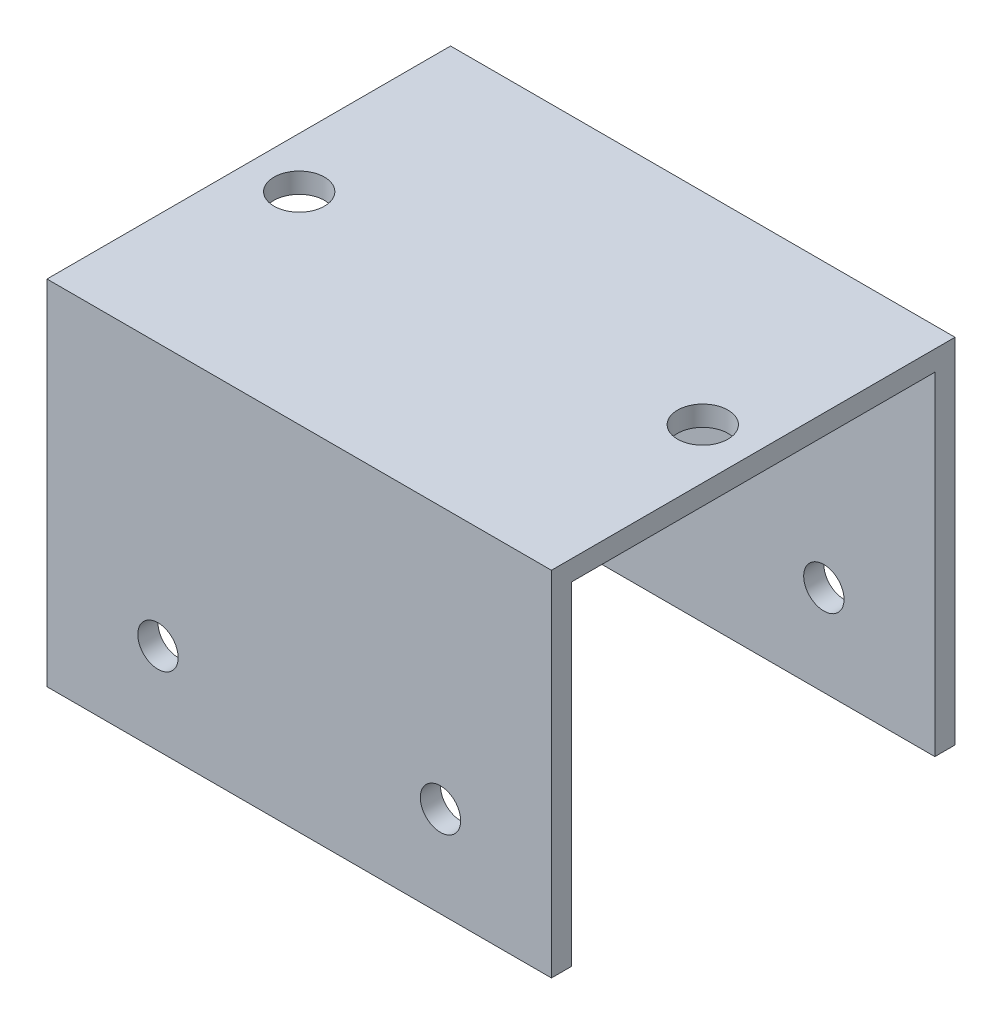
ISO-10303-21;
HEADER;
FILE_DESCRIPTION(('STEP AP214'),'2;1');
FILE_NAME('part.step','',(''),(''),'','','');
FILE_SCHEMA(('AUTOMOTIVE_DESIGN { 1 0 10303 214 1 1 1 1 }'));
ENDSEC;
DATA;
#1=APPLICATION_CONTEXT('core data for automotive mechanical design processes');
#2=APPLICATION_PROTOCOL_DEFINITION('international standard','automotive_design',2000,#1);
#3=PRODUCT_CONTEXT('',#1,'mechanical');
#4=PRODUCT('Part','Part','',(#3));
#5=PRODUCT_RELATED_PRODUCT_CATEGORY('part','',(#4));
#6=PRODUCT_DEFINITION_FORMATION('','',#4);
#7=PRODUCT_DEFINITION_CONTEXT('part definition',#1,'design');
#8=PRODUCT_DEFINITION('design','',#6,#7);
#9=PRODUCT_DEFINITION_SHAPE('','',#8);
#10=(LENGTH_UNIT() NAMED_UNIT(*) SI_UNIT(.MILLI.,.METRE.));
#11=(NAMED_UNIT(*) PLANE_ANGLE_UNIT() SI_UNIT($,.RADIAN.));
#12=(NAMED_UNIT(*) SI_UNIT($,.STERADIAN.) SOLID_ANGLE_UNIT());
#13=UNCERTAINTY_MEASURE_WITH_UNIT(LENGTH_MEASURE(1.E-05),#10,'distance_accuracy_value','');
#14=(GEOMETRIC_REPRESENTATION_CONTEXT(3) GLOBAL_UNCERTAINTY_ASSIGNED_CONTEXT((#13)) GLOBAL_UNIT_ASSIGNED_CONTEXT((#10,
#11,#12)) REPRESENTATION_CONTEXT('',''));
#15=CARTESIAN_POINT('',(0.,0.,0.));
#16=DIRECTION('',(0.,0.,1.));
#17=DIRECTION('',(1.,0.,0.));
#18=AXIS2_PLACEMENT_3D('',#15,#16,#17);
#19=CARTESIAN_POINT('',(25.,0.,-18.));
#20=DIRECTION('',(0.,1.,0.));
#21=DIRECTION('',(0.,0.,1.));
#22=AXIS2_PLACEMENT_3D('',#19,#20,#21);
#23=PLANE('',#22);
#24=DIRECTION('',(0.,0.,-1.));
#25=VECTOR('',#24,1.);
#26=CARTESIAN_POINT('',(-25.,0.,-18.));
#27=LINE('',#26,#25);
#28=CARTESIAN_POINT('',(-25.,0.,-18.));
#29=VERTEX_POINT('',#28);
#30=CARTESIAN_POINT('',(-25.,0.,-20.));
#31=VERTEX_POINT('',#30);
#32=EDGE_CURVE('E134',#29,#31,#27,.T.);
#33=ORIENTED_EDGE('',*,*,#32,.T.);
#34=DIRECTION('',(-1.,0.,0.));
#35=VECTOR('',#34,1.);
#36=CARTESIAN_POINT('',(25.,0.,-20.));
#37=LINE('',#36,#35);
#38=CARTESIAN_POINT('',(25.,0.,-20.));
#39=VERTEX_POINT('',#38);
#40=EDGE_CURVE('E11',#39,#31,#37,.T.);
#41=ORIENTED_EDGE('',*,*,#40,.F.);
#42=DIRECTION('',(0.,0.,-1.));
#43=VECTOR('',#42,1.);
#44=CARTESIAN_POINT('',(25.,0.,-18.));
#45=LINE('',#44,#43);
#46=CARTESIAN_POINT('',(25.,0.,-18.));
#47=VERTEX_POINT('',#46);
#48=EDGE_CURVE('E149',#47,#39,#45,.T.);
#49=ORIENTED_EDGE('',*,*,#48,.F.);
#50=DIRECTION('',(-1.,0.,0.));
#51=VECTOR('',#50,1.);
#52=CARTESIAN_POINT('',(25.,0.,-18.));
#53=LINE('',#52,#51);
#54=EDGE_CURVE('E130',#47,#29,#53,.T.);
#55=ORIENTED_EDGE('',*,*,#54,.T.);
#56=EDGE_LOOP('',(#33,#41,#49,#55));
#57=FACE_BOUND('',#56,.T.);
#58=ADVANCED_FACE('F36',(#57),#23,.F.);
#59=CARTESIAN_POINT('',(25.,35.,-20.));
#60=DIRECTION('',(0.,0.,1.));
#61=DIRECTION('',(0.,-1.,0.));
#62=AXIS2_PLACEMENT_3D('',#59,#60,#61);
#63=PLANE('',#62);
#64=CARTESIAN_POINT('',(14.,9.,-20.));
#65=DIRECTION('',(0.,0.,1.));
#66=DIRECTION('',(1.,0.,0.));
#67=AXIS2_PLACEMENT_3D('',#64,#65,#66);
#68=CIRCLE('',#67,2.);
#69=CARTESIAN_POINT('',(16.,9.,-20.));
#70=VERTEX_POINT('',#69);
#71=EDGE_CURVE('E168',#70,#70,#68,.T.);
#72=ORIENTED_EDGE('',*,*,#71,.T.);
#73=EDGE_LOOP('',(#72));
#74=FACE_BOUND('',#73,.T.);
#75=CARTESIAN_POINT('',(-14.,9.,-20.));
#76=DIRECTION('',(0.,0.,1.));
#77=DIRECTION('',(1.,0.,0.));
#78=AXIS2_PLACEMENT_3D('',#75,#76,#77);
#79=CIRCLE('',#78,2.);
#80=CARTESIAN_POINT('',(-12.,9.,-20.));
#81=VERTEX_POINT('',#80);
#82=EDGE_CURVE('E164',#81,#81,#79,.T.);
#83=ORIENTED_EDGE('',*,*,#82,.T.);
#84=EDGE_LOOP('',(#83));
#85=FACE_BOUND('',#84,.T.);
#86=DIRECTION('',(0.,1.,0.));
#87=VECTOR('',#86,1.);
#88=CARTESIAN_POINT('',(-25.,35.,-20.));
#89=LINE('',#88,#87);
#90=CARTESIAN_POINT('',(-25.,35.,-20.));
#91=VERTEX_POINT('',#90);
#92=EDGE_CURVE('E137',#31,#91,#89,.T.);
#93=ORIENTED_EDGE('',*,*,#92,.T.);
#94=DIRECTION('',(-1.,0.,0.));
#95=VECTOR('',#94,1.);
#96=CARTESIAN_POINT('',(25.,35.,-20.));
#97=LINE('',#96,#95);
#98=CARTESIAN_POINT('',(25.,35.,-20.));
#99=VERTEX_POINT('',#98);
#100=EDGE_CURVE('E45',#99,#91,#97,.T.);
#101=ORIENTED_EDGE('',*,*,#100,.F.);
#102=DIRECTION('',(0.,1.,0.));
#103=VECTOR('',#102,1.);
#104=CARTESIAN_POINT('',(25.,35.,-20.));
#105=LINE('',#104,#103);
#106=EDGE_CURVE('E97',#39,#99,#105,.T.);
#107=ORIENTED_EDGE('',*,*,#106,.F.);
#108=ORIENTED_EDGE('',*,*,#40,.T.);
#109=EDGE_LOOP('',(#93,#101,#107,#108));
#110=FACE_BOUND('',#109,.T.);
#111=ADVANCED_FACE('F233',(#74,#85,#110),#63,.F.);
#112=CARTESIAN_POINT('',(25.,35.,20.));
#113=DIRECTION('',(0.,-1.,0.));
#114=DIRECTION('',(0.,0.,-1.));
#115=AXIS2_PLACEMENT_3D('',#112,#113,#114);
#116=PLANE('',#115);
#117=CARTESIAN_POINT('',(19.9999999999767,35.,0.));
#118=DIRECTION('',(0.,1.,0.));
#119=DIRECTION('',(0.,0.,1.));
#120=AXIS2_PLACEMENT_3D('',#117,#118,#119);
#121=CIRCLE('',#120,2.5);
#122=CARTESIAN_POINT('',(19.9999999999767,35.,2.5));
#123=VERTEX_POINT('',#122);
#124=EDGE_CURVE('E182',#123,#123,#121,.T.);
#125=ORIENTED_EDGE('',*,*,#124,.F.);
#126=EDGE_LOOP('',(#125));
#127=FACE_BOUND('',#126,.T.);
#128=CARTESIAN_POINT('',(-20.,35.,0.));
#129=DIRECTION('',(0.,1.,0.));
#130=DIRECTION('',(0.,0.,1.));
#131=AXIS2_PLACEMENT_3D('',#128,#129,#130);
#132=CIRCLE('',#131,2.5);
#133=CARTESIAN_POINT('',(-20.,35.,2.5));
#134=VERTEX_POINT('',#133);
#135=EDGE_CURVE('E172',#134,#134,#132,.T.);
#136=ORIENTED_EDGE('',*,*,#135,.F.);
#137=EDGE_LOOP('',(#136));
#138=FACE_BOUND('',#137,.T.);
#139=DIRECTION('',(0.,0.,1.));
#140=VECTOR('',#139,1.);
#141=CARTESIAN_POINT('',(-25.,35.,20.));
#142=LINE('',#141,#140);
#143=CARTESIAN_POINT('',(-25.,35.,20.));
#144=VERTEX_POINT('',#143);
#145=EDGE_CURVE('E140',#91,#144,#142,.T.);
#146=ORIENTED_EDGE('',*,*,#145,.T.);
#147=DIRECTION('',(-1.,0.,0.));
#148=VECTOR('',#147,1.);
#149=CARTESIAN_POINT('',(25.,35.,20.));
#150=LINE('',#149,#148);
#151=CARTESIAN_POINT('',(25.,35.,20.));
#152=VERTEX_POINT('',#151);
#153=EDGE_CURVE('E156',#152,#144,#150,.T.);
#154=ORIENTED_EDGE('',*,*,#153,.F.);
#155=DIRECTION('',(0.,0.,1.));
#156=VECTOR('',#155,1.);
#157=CARTESIAN_POINT('',(25.,35.,20.));
#158=LINE('',#157,#156);
#159=EDGE_CURVE('E198',#99,#152,#158,.T.);
#160=ORIENTED_EDGE('',*,*,#159,.F.);
#161=ORIENTED_EDGE('',*,*,#100,.T.);
#162=EDGE_LOOP('',(#146,#154,#160,#161));
#163=FACE_BOUND('',#162,.T.);
#164=ADVANCED_FACE('F237',(#127,#138,#163),#116,.F.);
#165=CARTESIAN_POINT('',(25.,35.,20.));
#166=DIRECTION('',(0.,0.,-1.));
#167=DIRECTION('',(0.,1.,0.));
#168=AXIS2_PLACEMENT_3D('',#165,#166,#167);
#169=PLANE('',#168);
#170=CARTESIAN_POINT('',(14.,9.,20.));
#171=DIRECTION('',(0.,0.,1.));
#172=DIRECTION('',(1.,0.,0.));
#173=AXIS2_PLACEMENT_3D('',#170,#171,#172);
#174=CIRCLE('',#173,2.);
#175=CARTESIAN_POINT('',(16.,9.,20.));
#176=VERTEX_POINT('',#175);
#177=EDGE_CURVE('E171',#176,#176,#174,.T.);
#178=ORIENTED_EDGE('',*,*,#177,.F.);
#179=EDGE_LOOP('',(#178));
#180=FACE_BOUND('',#179,.T.);
#181=CARTESIAN_POINT('',(-14.,9.,20.));
#182=DIRECTION('',(0.,0.,1.));
#183=DIRECTION('',(1.,0.,0.));
#184=AXIS2_PLACEMENT_3D('',#181,#182,#183);
#185=CIRCLE('',#184,2.);
#186=CARTESIAN_POINT('',(-12.,9.,20.));
#187=VERTEX_POINT('',#186);
#188=EDGE_CURVE('E189',#187,#187,#185,.T.);
#189=ORIENTED_EDGE('',*,*,#188,.F.);
#190=EDGE_LOOP('',(#189));
#191=FACE_BOUND('',#190,.T.);
#192=DIRECTION('',(0.,-1.,0.));
#193=VECTOR('',#192,1.);
#194=CARTESIAN_POINT('',(-25.,35.,20.));
#195=LINE('',#194,#193);
#196=CARTESIAN_POINT('',(-25.,0.,20.));
#197=VERTEX_POINT('',#196);
#198=EDGE_CURVE('E142',#144,#197,#195,.T.);
#199=ORIENTED_EDGE('',*,*,#198,.T.);
#200=DIRECTION('',(-1.,0.,0.));
#201=VECTOR('',#200,1.);
#202=CARTESIAN_POINT('',(25.,0.,20.));
#203=LINE('',#202,#201);
#204=CARTESIAN_POINT('',(25.,0.,20.));
#205=VERTEX_POINT('',#204);
#206=EDGE_CURVE('E153',#205,#197,#203,.T.);
#207=ORIENTED_EDGE('',*,*,#206,.F.);
#208=DIRECTION('',(0.,-1.,0.));
#209=VECTOR('',#208,1.);
#210=CARTESIAN_POINT('',(25.,35.,20.));
#211=LINE('',#210,#209);
#212=EDGE_CURVE('E200',#152,#205,#211,.T.);
#213=ORIENTED_EDGE('',*,*,#212,.F.);
#214=ORIENTED_EDGE('',*,*,#153,.T.);
#215=EDGE_LOOP('',(#199,#207,#213,#214));
#216=FACE_BOUND('',#215,.T.);
#217=ADVANCED_FACE('F206',(#180,#191,#216),#169,.F.);
#218=CARTESIAN_POINT('',(25.,0.,20.));
#219=DIRECTION('',(0.,1.,0.));
#220=DIRECTION('',(0.,0.,1.));
#221=AXIS2_PLACEMENT_3D('',#218,#219,#220);
#222=PLANE('',#221);
#223=DIRECTION('',(0.,0.,-1.));
#224=VECTOR('',#223,1.);
#225=CARTESIAN_POINT('',(-25.,0.,20.));
#226=LINE('',#225,#224);
#227=CARTESIAN_POINT('',(-25.,0.,18.));
#228=VERTEX_POINT('',#227);
#229=EDGE_CURVE('E144',#197,#228,#226,.T.);
#230=ORIENTED_EDGE('',*,*,#229,.T.);
#231=DIRECTION('',(-1.,0.,0.));
#232=VECTOR('',#231,1.);
#233=CARTESIAN_POINT('',(25.,0.,18.));
#234=LINE('',#233,#232);
#235=CARTESIAN_POINT('',(25.,0.,18.));
#236=VERTEX_POINT('',#235);
#237=EDGE_CURVE('E125',#236,#228,#234,.T.);
#238=ORIENTED_EDGE('',*,*,#237,.F.);
#239=DIRECTION('',(0.,0.,-1.));
#240=VECTOR('',#239,1.);
#241=CARTESIAN_POINT('',(25.,0.,20.));
#242=LINE('',#241,#240);
#243=EDGE_CURVE('E116',#205,#236,#242,.T.);
#244=ORIENTED_EDGE('',*,*,#243,.F.);
#245=ORIENTED_EDGE('',*,*,#206,.T.);
#246=EDGE_LOOP('',(#230,#238,#244,#245));
#247=FACE_BOUND('',#246,.T.);
#248=ADVANCED_FACE('F210',(#247),#222,.F.);
#249=CARTESIAN_POINT('',(25.,33.,18.));
#250=DIRECTION('',(0.,0.,1.));
#251=DIRECTION('',(1.,0.,0.));
#252=AXIS2_PLACEMENT_3D('',#249,#250,#251);
#253=PLANE('',#252);
#254=CARTESIAN_POINT('',(14.,9.,18.));
#255=DIRECTION('',(0.,0.,1.));
#256=DIRECTION('',(1.,0.,0.));
#257=AXIS2_PLACEMENT_3D('',#254,#255,#256);
#258=CIRCLE('',#257,2.);
#259=CARTESIAN_POINT('',(16.,9.,18.));
#260=VERTEX_POINT('',#259);
#261=EDGE_CURVE('E167',#260,#260,#258,.T.);
#262=ORIENTED_EDGE('',*,*,#261,.T.);
#263=EDGE_LOOP('',(#262));
#264=FACE_BOUND('',#263,.T.);
#265=CARTESIAN_POINT('',(-14.,9.,18.));
#266=DIRECTION('',(0.,0.,1.));
#267=DIRECTION('',(1.,0.,0.));
#268=AXIS2_PLACEMENT_3D('',#265,#266,#267);
#269=CIRCLE('',#268,2.);
#270=CARTESIAN_POINT('',(-12.,9.,18.));
#271=VERTEX_POINT('',#270);
#272=EDGE_CURVE('E138',#271,#271,#269,.T.);
#273=ORIENTED_EDGE('',*,*,#272,.T.);
#274=EDGE_LOOP('',(#273));
#275=FACE_BOUND('',#274,.T.);
#276=DIRECTION('',(0.,1.,0.));
#277=VECTOR('',#276,1.);
#278=CARTESIAN_POINT('',(-25.,33.,18.));
#279=LINE('',#278,#277);
#280=CARTESIAN_POINT('',(-25.,33.,18.));
#281=VERTEX_POINT('',#280);
#282=EDGE_CURVE('E124',#228,#281,#279,.T.);
#283=ORIENTED_EDGE('',*,*,#282,.T.);
#284=DIRECTION('',(-1.,0.,0.));
#285=VECTOR('',#284,1.);
#286=CARTESIAN_POINT('',(25.,33.,18.));
#287=LINE('',#286,#285);
#288=CARTESIAN_POINT('',(25.,33.,18.));
#289=VERTEX_POINT('',#288);
#290=EDGE_CURVE('E121',#289,#281,#287,.T.);
#291=ORIENTED_EDGE('',*,*,#290,.F.);
#292=DIRECTION('',(0.,1.,0.));
#293=VECTOR('',#292,1.);
#294=CARTESIAN_POINT('',(25.,33.,18.));
#295=LINE('',#294,#293);
#296=EDGE_CURVE('E110',#236,#289,#295,.T.);
#297=ORIENTED_EDGE('',*,*,#296,.F.);
#298=ORIENTED_EDGE('',*,*,#237,.T.);
#299=EDGE_LOOP('',(#283,#291,#297,#298));
#300=FACE_BOUND('',#299,.T.);
#301=ADVANCED_FACE('F122',(#264,#275,#300),#253,.F.);
#302=CARTESIAN_POINT('',(25.,33.,18.));
#303=DIRECTION('',(0.,1.,0.));
#304=DIRECTION('',(0.,0.,1.));
#305=AXIS2_PLACEMENT_3D('',#302,#303,#304);
#306=PLANE('',#305);
#307=CARTESIAN_POINT('',(19.9999999999767,33.,0.));
#308=DIRECTION('',(0.,1.,0.));
#309=DIRECTION('',(0.,0.,1.));
#310=AXIS2_PLACEMENT_3D('',#307,#308,#309);
#311=CIRCLE('',#310,2.5);
#312=CARTESIAN_POINT('',(19.9999999999767,33.,2.5));
#313=VERTEX_POINT('',#312);
#314=EDGE_CURVE('E39',#313,#313,#311,.T.);
#315=ORIENTED_EDGE('',*,*,#314,.T.);
#316=EDGE_LOOP('',(#315));
#317=FACE_BOUND('',#316,.T.);
#318=CARTESIAN_POINT('',(-20.,33.,0.));
#319=DIRECTION('',(0.,1.,0.));
#320=DIRECTION('',(0.,0.,1.));
#321=AXIS2_PLACEMENT_3D('',#318,#319,#320);
#322=CIRCLE('',#321,2.5);
#323=CARTESIAN_POINT('',(-20.,33.,2.5));
#324=VERTEX_POINT('',#323);
#325=EDGE_CURVE('E169',#324,#324,#322,.T.);
#326=ORIENTED_EDGE('',*,*,#325,.T.);
#327=EDGE_LOOP('',(#326));
#328=FACE_BOUND('',#327,.T.);
#329=DIRECTION('',(0.,0.,-1.));
#330=VECTOR('',#329,1.);
#331=CARTESIAN_POINT('',(-25.,33.,18.));
#332=LINE('',#331,#330);
#333=CARTESIAN_POINT('',(-25.,33.,-18.));
#334=VERTEX_POINT('',#333);
#335=EDGE_CURVE('E83',#281,#334,#332,.T.);
#336=ORIENTED_EDGE('',*,*,#335,.T.);
#337=DIRECTION('',(-1.,0.,0.));
#338=VECTOR('',#337,1.);
#339=CARTESIAN_POINT('',(25.,33.,-18.));
#340=LINE('',#339,#338);
#341=CARTESIAN_POINT('',(25.,33.,-18.));
#342=VERTEX_POINT('',#341);
#343=EDGE_CURVE('E126',#342,#334,#340,.T.);
#344=ORIENTED_EDGE('',*,*,#343,.F.);
#345=DIRECTION('',(0.,0.,-1.));
#346=VECTOR('',#345,1.);
#347=CARTESIAN_POINT('',(25.,33.,18.));
#348=LINE('',#347,#346);
#349=EDGE_CURVE('E114',#289,#342,#348,.T.);
#350=ORIENTED_EDGE('',*,*,#349,.F.);
#351=ORIENTED_EDGE('',*,*,#290,.T.);
#352=EDGE_LOOP('',(#336,#344,#350,#351));
#353=FACE_BOUND('',#352,.T.);
#354=ADVANCED_FACE('F128',(#317,#328,#353),#306,.F.);
#355=CARTESIAN_POINT('',(25.,33.,-18.));
#356=DIRECTION('',(0.,0.,-1.));
#357=DIRECTION('',(-1.,0.,0.));
#358=AXIS2_PLACEMENT_3D('',#355,#356,#357);
#359=PLANE('',#358);
#360=CARTESIAN_POINT('',(14.,9.,-18.));
#361=DIRECTION('',(0.,0.,-1.));
#362=DIRECTION('',(-1.,0.,0.));
#363=AXIS2_PLACEMENT_3D('',#360,#361,#362);
#364=CIRCLE('',#363,2.);
#365=CARTESIAN_POINT('',(12.,9.,-18.));
#366=VERTEX_POINT('',#365);
#367=EDGE_CURVE('E165',#366,#366,#364,.T.);
#368=ORIENTED_EDGE('',*,*,#367,.T.);
#369=EDGE_LOOP('',(#368));
#370=FACE_BOUND('',#369,.T.);
#371=CARTESIAN_POINT('',(-14.,9.,-18.));
#372=DIRECTION('',(0.,0.,-1.));
#373=DIRECTION('',(-1.,0.,0.));
#374=AXIS2_PLACEMENT_3D('',#371,#372,#373);
#375=CIRCLE('',#374,2.);
#376=CARTESIAN_POINT('',(-16.,9.,-18.));
#377=VERTEX_POINT('',#376);
#378=EDGE_CURVE('E161',#377,#377,#375,.T.);
#379=ORIENTED_EDGE('',*,*,#378,.T.);
#380=EDGE_LOOP('',(#379));
#381=FACE_BOUND('',#380,.T.);
#382=DIRECTION('',(0.,-1.,0.));
#383=VECTOR('',#382,1.);
#384=CARTESIAN_POINT('',(-25.,33.,-18.));
#385=LINE('',#384,#383);
#386=EDGE_CURVE('E89',#334,#29,#385,.T.);
#387=ORIENTED_EDGE('',*,*,#386,.T.);
#388=ORIENTED_EDGE('',*,*,#54,.F.);
#389=DIRECTION('',(0.,-1.,0.));
#390=VECTOR('',#389,1.);
#391=CARTESIAN_POINT('',(25.,33.,-18.));
#392=LINE('',#391,#390);
#393=EDGE_CURVE('E54',#342,#47,#392,.T.);
#394=ORIENTED_EDGE('',*,*,#393,.F.);
#395=ORIENTED_EDGE('',*,*,#343,.T.);
#396=EDGE_LOOP('',(#387,#388,#394,#395));
#397=FACE_BOUND('',#396,.T.);
#398=ADVANCED_FACE('F218',(#370,#381,#397),#359,.F.);
#399=CARTESIAN_POINT('',(25.,0.,0.));
#400=DIRECTION('',(-1.,0.,0.));
#401=DIRECTION('',(0.,0.,1.));
#402=AXIS2_PLACEMENT_3D('',#399,#400,#401);
#403=PLANE('',#402);
#404=ORIENTED_EDGE('',*,*,#48,.T.);
#405=ORIENTED_EDGE('',*,*,#106,.T.);
#406=ORIENTED_EDGE('',*,*,#159,.T.);
#407=ORIENTED_EDGE('',*,*,#212,.T.);
#408=ORIENTED_EDGE('',*,*,#243,.T.);
#409=ORIENTED_EDGE('',*,*,#296,.T.);
#410=ORIENTED_EDGE('',*,*,#349,.T.);
#411=ORIENTED_EDGE('',*,*,#393,.T.);
#412=EDGE_LOOP('',(#404,#405,#406,#407,#408,#409,#410,#411));
#413=FACE_BOUND('',#412,.T.);
#414=ADVANCED_FACE('F112',(#413),#403,.F.);
#415=CARTESIAN_POINT('',(-25.,0.,0.));
#416=DIRECTION('',(-1.,0.,0.));
#417=DIRECTION('',(0.,0.,1.));
#418=AXIS2_PLACEMENT_3D('',#415,#416,#417);
#419=PLANE('',#418);
#420=ORIENTED_EDGE('',*,*,#32,.F.);
#421=ORIENTED_EDGE('',*,*,#386,.F.);
#422=ORIENTED_EDGE('',*,*,#335,.F.);
#423=ORIENTED_EDGE('',*,*,#282,.F.);
#424=ORIENTED_EDGE('',*,*,#229,.F.);
#425=ORIENTED_EDGE('',*,*,#198,.F.);
#426=ORIENTED_EDGE('',*,*,#145,.F.);
#427=ORIENTED_EDGE('',*,*,#92,.F.);
#428=EDGE_LOOP('',(#420,#421,#422,#423,#424,#425,#426,#427));
#429=FACE_BOUND('',#428,.T.);
#430=ADVANCED_FACE('F213',(#429),#419,.T.);
#431=CARTESIAN_POINT('',(-14.,9.,-20.));
#432=DIRECTION('',(0.,0.,1.));
#433=DIRECTION('',(1.,0.,0.));
#434=AXIS2_PLACEMENT_3D('',#431,#432,#433);
#435=CYLINDRICAL_SURFACE('',#434,2.);
#436=ORIENTED_EDGE('',*,*,#82,.F.);
#437=EDGE_LOOP('',(#436));
#438=FACE_BOUND('',#437,.T.);
#439=ORIENTED_EDGE('',*,*,#378,.F.);
#440=EDGE_LOOP('',(#439));
#441=FACE_BOUND('',#440,.T.);
#442=ADVANCED_FACE('F263',(#438,#441),#435,.F.);
#443=ORIENTED_EDGE('',*,*,#188,.T.);
#444=EDGE_LOOP('',(#443));
#445=FACE_BOUND('',#444,.T.);
#446=ORIENTED_EDGE('',*,*,#272,.F.);
#447=EDGE_LOOP('',(#446));
#448=FACE_BOUND('',#447,.T.);
#449=ADVANCED_FACE('F260',(#445,#448),#435,.F.);
#450=CARTESIAN_POINT('',(14.,9.,-20.));
#451=DIRECTION('',(0.,0.,1.));
#452=DIRECTION('',(1.,0.,0.));
#453=AXIS2_PLACEMENT_3D('',#450,#451,#452);
#454=CYLINDRICAL_SURFACE('',#453,2.);
#455=ORIENTED_EDGE('',*,*,#71,.F.);
#456=EDGE_LOOP('',(#455));
#457=FACE_BOUND('',#456,.T.);
#458=ORIENTED_EDGE('',*,*,#367,.F.);
#459=EDGE_LOOP('',(#458));
#460=FACE_BOUND('',#459,.T.);
#461=ADVANCED_FACE('F262',(#457,#460),#454,.F.);
#462=ORIENTED_EDGE('',*,*,#177,.T.);
#463=EDGE_LOOP('',(#462));
#464=FACE_BOUND('',#463,.T.);
#465=ORIENTED_EDGE('',*,*,#261,.F.);
#466=EDGE_LOOP('',(#465));
#467=FACE_BOUND('',#466,.T.);
#468=ADVANCED_FACE('F270',(#464,#467),#454,.F.);
#469=CARTESIAN_POINT('',(-20.,25.,0.));
#470=DIRECTION('',(0.,1.,0.));
#471=DIRECTION('',(0.,0.,1.));
#472=AXIS2_PLACEMENT_3D('',#469,#470,#471);
#473=CYLINDRICAL_SURFACE('',#472,2.5);
#474=ORIENTED_EDGE('',*,*,#135,.T.);
#475=EDGE_LOOP('',(#474));
#476=FACE_BOUND('',#475,.T.);
#477=ORIENTED_EDGE('',*,*,#325,.F.);
#478=EDGE_LOOP('',(#477));
#479=FACE_BOUND('',#478,.T.);
#480=ADVANCED_FACE('F304',(#476,#479),#473,.F.);
#481=CARTESIAN_POINT('',(19.9999999999767,25.,0.));
#482=DIRECTION('',(0.,1.,0.));
#483=DIRECTION('',(0.,0.,1.));
#484=AXIS2_PLACEMENT_3D('',#481,#482,#483);
#485=CYLINDRICAL_SURFACE('',#484,2.5);
#486=ORIENTED_EDGE('',*,*,#124,.T.);
#487=EDGE_LOOP('',(#486));
#488=FACE_BOUND('',#487,.T.);
#489=ORIENTED_EDGE('',*,*,#314,.F.);
#490=EDGE_LOOP('',(#489));
#491=FACE_BOUND('',#490,.T.);
#492=ADVANCED_FACE('F320',(#488,#491),#485,.F.);
#493=CLOSED_SHELL('',(#58,#111,#164,#217,#248,#301,#354,#398,#414,#430,#442,#449,#461,#468,#480,#492));
#494=MANIFOLD_SOLID_BREP('B2',#493);
#495=ADVANCED_BREP_SHAPE_REPRESENTATION('',(#18,#494),#14);
#496=SHAPE_DEFINITION_REPRESENTATION(#9,#495);
ENDSEC;
END-ISO-10303-21;
